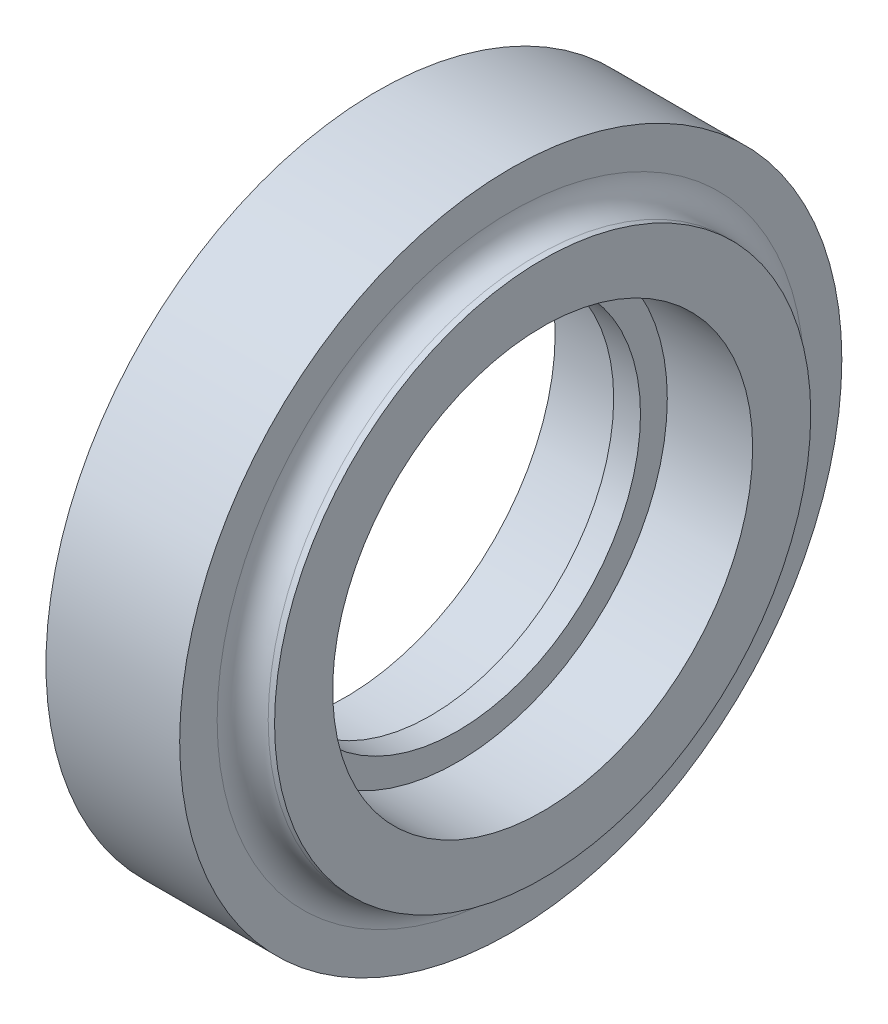
ISO-10303-21;
HEADER;
FILE_DESCRIPTION(('STEP AP214'),'2;1');
FILE_NAME('part.step','',(''),(''),'','','');
FILE_SCHEMA(('AUTOMOTIVE_DESIGN { 1 0 10303 214 1 1 1 1 }'));
ENDSEC;
DATA;
#1=APPLICATION_CONTEXT('core data for automotive mechanical design processes');
#2=APPLICATION_PROTOCOL_DEFINITION('international standard','automotive_design',2000,#1);
#3=PRODUCT_CONTEXT('',#1,'mechanical');
#4=PRODUCT('Part','Part','',(#3));
#5=PRODUCT_RELATED_PRODUCT_CATEGORY('part','',(#4));
#6=PRODUCT_DEFINITION_FORMATION('','',#4);
#7=PRODUCT_DEFINITION_CONTEXT('part definition',#1,'design');
#8=PRODUCT_DEFINITION('design','',#6,#7);
#9=PRODUCT_DEFINITION_SHAPE('','',#8);
#10=(LENGTH_UNIT() NAMED_UNIT(*) SI_UNIT(.MILLI.,.METRE.));
#11=(NAMED_UNIT(*) PLANE_ANGLE_UNIT() SI_UNIT($,.RADIAN.));
#12=(NAMED_UNIT(*) SI_UNIT($,.STERADIAN.) SOLID_ANGLE_UNIT());
#13=UNCERTAINTY_MEASURE_WITH_UNIT(LENGTH_MEASURE(1.E-05),#10,'distance_accuracy_value','');
#14=(GEOMETRIC_REPRESENTATION_CONTEXT(3) GLOBAL_UNCERTAINTY_ASSIGNED_CONTEXT((#13)) GLOBAL_UNIT_ASSIGNED_CONTEXT((#10,
#11,#12)) REPRESENTATION_CONTEXT('',''));
#15=CARTESIAN_POINT('',(0.,0.,0.));
#16=DIRECTION('',(0.,0.,1.));
#17=DIRECTION('',(1.,0.,0.));
#18=AXIS2_PLACEMENT_3D('',#15,#16,#17);
#19=CARTESIAN_POINT('',(-11.0503561338148,0.,0.));
#20=DIRECTION('',(1.,0.,0.));
#21=DIRECTION('',(0.,0.,-1.));
#22=AXIS2_PLACEMENT_3D('',#19,#20,#21);
#23=CYLINDRICAL_SURFACE('',#22,23.5);
#24=CARTESIAN_POINT('',(-11.0503561338148,0.,0.));
#25=DIRECTION('',(1.,0.,0.));
#26=DIRECTION('',(0.,0.,-1.));
#27=AXIS2_PLACEMENT_3D('',#24,#25,#26);
#28=CIRCLE('',#27,23.5);
#29=CARTESIAN_POINT('',(-11.0503561338148,0.,-23.5));
#30=VERTEX_POINT('',#29);
#31=EDGE_CURVE('E63',#30,#30,#28,.T.);
#32=ORIENTED_EDGE('',*,*,#31,.F.);
#33=EDGE_LOOP('',(#32));
#34=FACE_BOUND('',#33,.T.);
#35=CARTESIAN_POINT('',(-1.5,0.,0.));
#36=DIRECTION('',(1.,0.,0.));
#37=DIRECTION('',(0.,0.,-1.));
#38=AXIS2_PLACEMENT_3D('',#35,#36,#37);
#39=CIRCLE('',#38,23.5);
#40=CARTESIAN_POINT('',(-1.5,0.,-23.5));
#41=VERTEX_POINT('',#40);
#42=EDGE_CURVE('E11',#41,#41,#39,.F.);
#43=ORIENTED_EDGE('',*,*,#42,.F.);
#44=EDGE_LOOP('',(#43));
#45=FACE_BOUND('',#44,.T.);
#46=ADVANCED_FACE('F34',(#34,#45),#23,.F.);
#47=CARTESIAN_POINT('',(7.48125,37.1382122676296,0.));
#48=DIRECTION('',(-1.,0.,0.));
#49=DIRECTION('',(0.,0.,1.));
#50=AXIS2_PLACEMENT_3D('',#47,#48,#49);
#51=PLANE('',#50);
#52=CARTESIAN_POINT('',(7.48125,0.,0.));
#53=DIRECTION('',(-1.,0.,0.));
#54=DIRECTION('',(0.,0.,1.));
#55=AXIS2_PLACEMENT_3D('',#52,#53,#54);
#56=CIRCLE('',#55,32.8552849070519);
#57=CARTESIAN_POINT('',(7.48125,0.,32.8552849070519));
#58=VERTEX_POINT('',#57);
#59=EDGE_CURVE('E49',#58,#58,#56,.T.);
#60=ORIENTED_EDGE('',*,*,#59,.T.);
#61=EDGE_LOOP('',(#60));
#62=FACE_BOUND('',#61,.T.);
#63=CARTESIAN_POINT('',(7.48125,0.,0.));
#64=DIRECTION('',(-1.,0.,0.));
#65=DIRECTION('',(0.,0.,1.));
#66=AXIS2_PLACEMENT_3D('',#63,#64,#65);
#67=CIRCLE('',#66,37.0485122676296);
#68=CARTESIAN_POINT('',(7.48125,0.,37.0485122676296));
#69=VERTEX_POINT('',#68);
#70=EDGE_CURVE('E69',#69,#69,#67,.T.);
#71=ORIENTED_EDGE('',*,*,#70,.F.);
#72=EDGE_LOOP('',(#71));
#73=FACE_BOUND('',#72,.T.);
#74=ADVANCED_FACE('F104',(#62,#73),#51,.F.);
#75=CARTESIAN_POINT('',(-7.48125,32.8552849070519,0.));
#76=DIRECTION('',(1.,0.,0.));
#77=DIRECTION('',(0.,0.,-1.));
#78=AXIS2_PLACEMENT_3D('',#75,#76,#77);
#79=PLANE('',#78);
#80=CARTESIAN_POINT('',(-7.48125,0.,0.));
#81=DIRECTION('',(-1.,0.,0.));
#82=DIRECTION('',(0.,0.,1.));
#83=AXIS2_PLACEMENT_3D('',#80,#81,#82);
#84=CIRCLE('',#83,32.8552849070519);
#85=CARTESIAN_POINT('',(-7.48125,0.,32.8552849070519));
#86=VERTEX_POINT('',#85);
#87=EDGE_CURVE('E54',#86,#86,#84,.T.);
#88=ORIENTED_EDGE('',*,*,#87,.F.);
#89=EDGE_LOOP('',(#88));
#90=FACE_BOUND('',#89,.T.);
#91=CARTESIAN_POINT('',(-7.48125,0.,0.));
#92=DIRECTION('',(1.,0.,0.));
#93=DIRECTION('',(0.,0.,-1.));
#94=AXIS2_PLACEMENT_3D('',#91,#92,#93);
#95=CIRCLE('',#94,37.0485122676296);
#96=CARTESIAN_POINT('',(-7.48125,0.,-37.0485122676296));
#97=VERTEX_POINT('',#96);
#98=EDGE_CURVE('E72',#97,#97,#95,.T.);
#99=ORIENTED_EDGE('',*,*,#98,.F.);
#100=EDGE_LOOP('',(#99));
#101=FACE_BOUND('',#100,.T.);
#102=ADVANCED_FACE('F110',(#90,#101),#79,.F.);
#103=CARTESIAN_POINT('',(11.0503561338148,30.,0.));
#104=DIRECTION('',(-1.,0.,0.));
#105=DIRECTION('',(0.,0.,1.));
#106=AXIS2_PLACEMENT_3D('',#103,#104,#105);
#107=PLANE('',#106);
#108=CARTESIAN_POINT('',(11.0503561338148,0.,0.));
#109=DIRECTION('',(1.,0.,0.));
#110=DIRECTION('',(0.,0.,-1.));
#111=AXIS2_PLACEMENT_3D('',#108,#109,#110);
#112=CIRCLE('',#111,23.5);
#113=CARTESIAN_POINT('',(11.0503561338148,0.,-23.5));
#114=VERTEX_POINT('',#113);
#115=EDGE_CURVE('E66',#114,#114,#112,.T.);
#116=ORIENTED_EDGE('',*,*,#115,.F.);
#117=EDGE_LOOP('',(#116));
#118=FACE_BOUND('',#117,.T.);
#119=CARTESIAN_POINT('',(11.0503561338148,0.,0.));
#120=DIRECTION('',(-1.,0.,0.));
#121=DIRECTION('',(0.,0.,1.));
#122=AXIS2_PLACEMENT_3D('',#119,#120,#121);
#123=CIRCLE('',#122,30.);
#124=CARTESIAN_POINT('',(11.0503561338148,0.,30.));
#125=VERTEX_POINT('',#124);
#126=EDGE_CURVE('E41',#125,#125,#123,.T.);
#127=ORIENTED_EDGE('',*,*,#126,.F.);
#128=EDGE_LOOP('',(#127));
#129=FACE_BOUND('',#128,.T.);
#130=ADVANCED_FACE('F36',(#118,#129),#107,.F.);
#131=CARTESIAN_POINT('',(-4.,0.,0.));
#132=DIRECTION('',(-1.,0.,0.));
#133=DIRECTION('',(0.,0.,1.));
#134=AXIS2_PLACEMENT_3D('',#131,#132,#133);
#135=CYLINDRICAL_SURFACE('',#134,30.);
#136=CARTESIAN_POINT('',(10.3365349070519,0.,0.));
#137=DIRECTION('',(-1.,0.,0.));
#138=DIRECTION('',(0.,0.,1.));
#139=AXIS2_PLACEMENT_3D('',#136,#137,#138);
#140=CIRCLE('',#139,30.);
#141=CARTESIAN_POINT('',(10.3365349070519,0.,30.));
#142=VERTEX_POINT('',#141);
#143=EDGE_CURVE('E45',#142,#142,#140,.T.);
#144=ORIENTED_EDGE('',*,*,#143,.F.);
#145=EDGE_LOOP('',(#144));
#146=FACE_BOUND('',#145,.T.);
#147=ORIENTED_EDGE('',*,*,#126,.T.);
#148=EDGE_LOOP('',(#147));
#149=FACE_BOUND('',#148,.T.);
#150=ADVANCED_FACE('F130',(#146,#149),#135,.T.);
#151=CARTESIAN_POINT('',(10.3365349070519,0.,0.));
#152=DIRECTION('',(-1.,0.,0.));
#153=DIRECTION('',(0.,0.,1.));
#154=AXIS2_PLACEMENT_3D('',#151,#152,#153);
#155=TOROIDAL_SURFACE('',#154,32.8552849070519,2.85528490705186);
#156=ORIENTED_EDGE('',*,*,#59,.F.);
#157=EDGE_LOOP('',(#156));
#158=FACE_BOUND('',#157,.T.);
#159=ORIENTED_EDGE('',*,*,#143,.T.);
#160=EDGE_LOOP('',(#159));
#161=FACE_BOUND('',#160,.T.);
#162=ADVANCED_FACE('F135',(#158,#161),#155,.F.);
#163=CARTESIAN_POINT('',(-10.3365349070519,0.,0.));
#164=DIRECTION('',(-1.,0.,0.));
#165=DIRECTION('',(0.,0.,1.));
#166=AXIS2_PLACEMENT_3D('',#163,#164,#165);
#167=TOROIDAL_SURFACE('',#166,32.8552849070519,2.85528490705186);
#168=CARTESIAN_POINT('',(-10.3365349070519,0.,0.));
#169=DIRECTION('',(-1.,0.,0.));
#170=DIRECTION('',(0.,0.,1.));
#171=AXIS2_PLACEMENT_3D('',#168,#169,#170);
#172=CIRCLE('',#171,30.);
#173=CARTESIAN_POINT('',(-10.3365349070519,0.,30.));
#174=VERTEX_POINT('',#173);
#175=EDGE_CURVE('E57',#174,#174,#172,.T.);
#176=ORIENTED_EDGE('',*,*,#175,.F.);
#177=EDGE_LOOP('',(#176));
#178=FACE_BOUND('',#177,.T.);
#179=ORIENTED_EDGE('',*,*,#87,.T.);
#180=EDGE_LOOP('',(#179));
#181=FACE_BOUND('',#180,.T.);
#182=ADVANCED_FACE('F144',(#178,#181),#167,.F.);
#183=CARTESIAN_POINT('',(-4.,0.,0.));
#184=DIRECTION('',(-1.,0.,0.));
#185=DIRECTION('',(0.,0.,1.));
#186=AXIS2_PLACEMENT_3D('',#183,#184,#185);
#187=CYLINDRICAL_SURFACE('',#186,30.);
#188=CARTESIAN_POINT('',(-11.0503561338148,0.,0.));
#189=DIRECTION('',(-1.,0.,0.));
#190=DIRECTION('',(0.,0.,1.));
#191=AXIS2_PLACEMENT_3D('',#188,#189,#190);
#192=CIRCLE('',#191,30.);
#193=CARTESIAN_POINT('',(-11.0503561338148,0.,30.));
#194=VERTEX_POINT('',#193);
#195=EDGE_CURVE('E60',#194,#194,#192,.T.);
#196=ORIENTED_EDGE('',*,*,#195,.F.);
#197=EDGE_LOOP('',(#196));
#198=FACE_BOUND('',#197,.T.);
#199=ORIENTED_EDGE('',*,*,#175,.T.);
#200=EDGE_LOOP('',(#199));
#201=FACE_BOUND('',#200,.T.);
#202=ADVANCED_FACE('F122',(#198,#201),#187,.T.);
#203=CARTESIAN_POINT('',(-11.0503561338148,0.,0.));
#204=DIRECTION('',(1.,0.,0.));
#205=DIRECTION('',(0.,0.,-1.));
#206=AXIS2_PLACEMENT_3D('',#203,#204,#205);
#207=PLANE('',#206);
#208=ORIENTED_EDGE('',*,*,#31,.T.);
#209=EDGE_LOOP('',(#208));
#210=FACE_BOUND('',#209,.T.);
#211=ORIENTED_EDGE('',*,*,#195,.T.);
#212=EDGE_LOOP('',(#211));
#213=FACE_BOUND('',#212,.T.);
#214=ADVANCED_FACE('F117',(#210,#213),#207,.F.);
#215=CARTESIAN_POINT('',(1.5,0.,0.));
#216=DIRECTION('',(1.,0.,0.));
#217=DIRECTION('',(0.,0.,-1.));
#218=AXIS2_PLACEMENT_3D('',#215,#216,#217);
#219=CIRCLE('',#218,23.5);
#220=CARTESIAN_POINT('',(1.5,0.,-23.5));
#221=VERTEX_POINT('',#220);
#222=EDGE_CURVE('E75',#221,#221,#219,.T.);
#223=ORIENTED_EDGE('',*,*,#222,.F.);
#224=EDGE_LOOP('',(#223));
#225=FACE_BOUND('',#224,.T.);
#226=ORIENTED_EDGE('',*,*,#115,.T.);
#227=EDGE_LOOP('',(#226));
#228=FACE_BOUND('',#227,.T.);
#229=ADVANCED_FACE('F99',(#225,#228),#23,.F.);
#230=CARTESIAN_POINT('',(-11.0503561338148,0.,0.));
#231=DIRECTION('',(1.,0.,0.));
#232=DIRECTION('',(0.,0.,-1.));
#233=AXIS2_PLACEMENT_3D('',#230,#231,#232);
#234=CYLINDRICAL_SURFACE('',#233,37.0485122676296);
#235=ORIENTED_EDGE('',*,*,#70,.T.);
#236=EDGE_LOOP('',(#235));
#237=FACE_BOUND('',#236,.T.);
#238=ORIENTED_EDGE('',*,*,#98,.T.);
#239=EDGE_LOOP('',(#238));
#240=FACE_BOUND('',#239,.T.);
#241=ADVANCED_FACE('F91',(#237,#240),#234,.T.);
#242=CARTESIAN_POINT('',(1.5,0.,0.));
#243=DIRECTION('',(1.,0.,0.));
#244=DIRECTION('',(0.,0.,-1.));
#245=AXIS2_PLACEMENT_3D('',#242,#243,#244);
#246=PLANE('',#245);
#247=ORIENTED_EDGE('',*,*,#222,.T.);
#248=EDGE_LOOP('',(#247));
#249=FACE_BOUND('',#248,.T.);
#250=CARTESIAN_POINT('',(1.5,0.,0.));
#251=DIRECTION('',(1.,0.,0.));
#252=DIRECTION('',(0.,0.,-1.));
#253=AXIS2_PLACEMENT_3D('',#250,#251,#252);
#254=CIRCLE('',#253,20.5);
#255=CARTESIAN_POINT('',(1.5,0.,-20.5));
#256=VERTEX_POINT('',#255);
#257=EDGE_CURVE('E78',#256,#256,#254,.T.);
#258=ORIENTED_EDGE('',*,*,#257,.F.);
#259=EDGE_LOOP('',(#258));
#260=FACE_BOUND('',#259,.T.);
#261=ADVANCED_FACE('F88',(#249,#260),#246,.T.);
#262=CARTESIAN_POINT('',(-1.5,0.,0.));
#263=DIRECTION('',(1.,0.,0.));
#264=DIRECTION('',(0.,0.,-1.));
#265=AXIS2_PLACEMENT_3D('',#262,#263,#264);
#266=PLANE('',#265);
#267=ORIENTED_EDGE('',*,*,#42,.T.);
#268=EDGE_LOOP('',(#267));
#269=FACE_BOUND('',#268,.T.);
#270=CARTESIAN_POINT('',(-1.5,0.,0.));
#271=DIRECTION('',(1.,0.,0.));
#272=DIRECTION('',(0.,0.,-1.));
#273=AXIS2_PLACEMENT_3D('',#270,#271,#272);
#274=CIRCLE('',#273,20.5);
#275=CARTESIAN_POINT('',(-1.5,0.,-20.5));
#276=VERTEX_POINT('',#275);
#277=EDGE_CURVE('E79',#276,#276,#274,.T.);
#278=ORIENTED_EDGE('',*,*,#277,.T.);
#279=EDGE_LOOP('',(#278));
#280=FACE_BOUND('',#279,.T.);
#281=ADVANCED_FACE('F90',(#269,#280),#266,.F.);
#282=CARTESIAN_POINT('',(1.5,0.,0.));
#283=DIRECTION('',(-1.,0.,0.));
#284=DIRECTION('',(0.,0.,1.));
#285=AXIS2_PLACEMENT_3D('',#282,#283,#284);
#286=CYLINDRICAL_SURFACE('',#285,20.5);
#287=ORIENTED_EDGE('',*,*,#257,.T.);
#288=EDGE_LOOP('',(#287));
#289=FACE_BOUND('',#288,.T.);
#290=ORIENTED_EDGE('',*,*,#277,.F.);
#291=EDGE_LOOP('',(#290));
#292=FACE_BOUND('',#291,.T.);
#293=ADVANCED_FACE('F85',(#289,#292),#286,.F.);
#294=CLOSED_SHELL('',(#46,#74,#102,#130,#150,#162,#182,#202,#214,#229,#241,#261,#281,#293));
#295=MANIFOLD_SOLID_BREP('B2',#294);
#296=ADVANCED_BREP_SHAPE_REPRESENTATION('',(#18,#295),#14);
#297=SHAPE_DEFINITION_REPRESENTATION(#9,#296);
ENDSEC;
END-ISO-10303-21;
